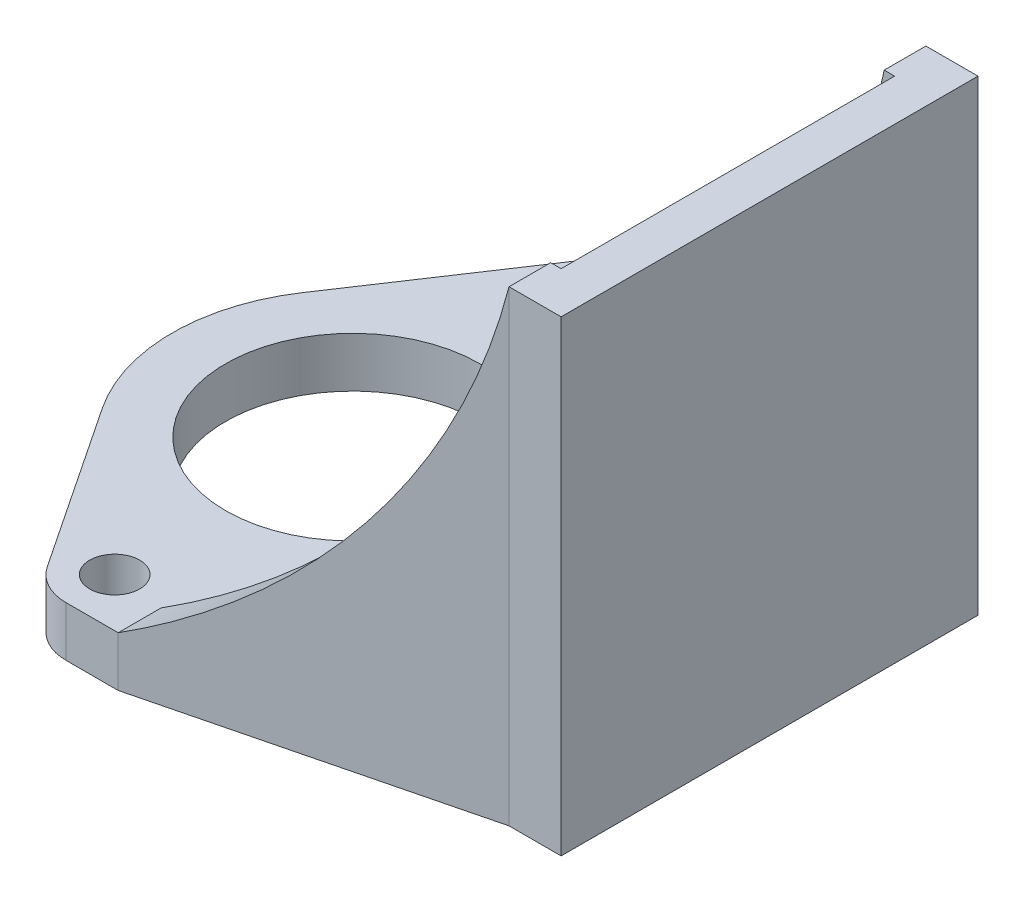
ISO-10303-21;
HEADER;
FILE_DESCRIPTION(('STEP AP214'),'2;1');
FILE_NAME('part.step','',(''),(''),'','','');
FILE_SCHEMA(('AUTOMOTIVE_DESIGN { 1 0 10303 214 1 1 1 1 }'));
ENDSEC;
DATA;
#1=APPLICATION_CONTEXT('core data for automotive mechanical design processes');
#2=APPLICATION_PROTOCOL_DEFINITION('international standard','automotive_design',2000,#1);
#3=PRODUCT_CONTEXT('',#1,'mechanical');
#4=PRODUCT('Part','Part','',(#3));
#5=PRODUCT_RELATED_PRODUCT_CATEGORY('part','',(#4));
#6=PRODUCT_DEFINITION_FORMATION('','',#4);
#7=PRODUCT_DEFINITION_CONTEXT('part definition',#1,'design');
#8=PRODUCT_DEFINITION('design','',#6,#7);
#9=PRODUCT_DEFINITION_SHAPE('','',#8);
#10=(LENGTH_UNIT() NAMED_UNIT(*) SI_UNIT(.MILLI.,.METRE.));
#11=(NAMED_UNIT(*) PLANE_ANGLE_UNIT() SI_UNIT($,.RADIAN.));
#12=(NAMED_UNIT(*) SI_UNIT($,.STERADIAN.) SOLID_ANGLE_UNIT());
#13=UNCERTAINTY_MEASURE_WITH_UNIT(LENGTH_MEASURE(1.E-05),#10,'distance_accuracy_value','');
#14=(GEOMETRIC_REPRESENTATION_CONTEXT(3) GLOBAL_UNCERTAINTY_ASSIGNED_CONTEXT((#13)) GLOBAL_UNIT_ASSIGNED_CONTEXT((#10,
#11,#12)) REPRESENTATION_CONTEXT('',''));
#15=CARTESIAN_POINT('',(0.,0.,0.));
#16=DIRECTION('',(0.,0.,1.));
#17=DIRECTION('',(1.,0.,0.));
#18=AXIS2_PLACEMENT_3D('',#15,#16,#17);
#19=CARTESIAN_POINT('',(0.,3.048,-14.5));
#20=DIRECTION('',(0.,1.,0.));
#21=DIRECTION('',(0.,0.,1.));
#22=AXIS2_PLACEMENT_3D('',#19,#20,#21);
#23=PLANE('',#22);
#24=CARTESIAN_POINT('',(0.,3.048,0.));
#25=DIRECTION('',(0.,1.,0.));
#26=DIRECTION('',(0.,0.,1.));
#27=AXIS2_PLACEMENT_3D('',#24,#25,#26);
#28=CIRCLE('',#27,7.75);
#29=CARTESIAN_POINT('',(0.,3.048,7.75));
#30=VERTEX_POINT('',#29);
#31=EDGE_CURVE('E367',#30,#30,#28,.T.);
#32=ORIENTED_EDGE('',*,*,#31,.F.);
#33=EDGE_LOOP('',(#32));
#34=FACE_BOUND('',#33,.T.);
#35=DIRECTION('',(0.970142500145332,0.,0.242535625036333));
#36=VECTOR('',#35,1.);
#37=CARTESIAN_POINT('',(21.9123117109311,3.048,-10.16));
#38=LINE('',#37,#36);
#39=CARTESIAN_POINT('',(3.175,3.048,-14.8443279277328));
#40=VERTEX_POINT('',#39);
#41=CARTESIAN_POINT('',(21.9123117109311,3.048,-10.16));
#42=VERTEX_POINT('',#41);
#43=EDGE_CURVE('E323',#40,#42,#38,.T.);
#44=ORIENTED_EDGE('',*,*,#43,.F.);
#45=DIRECTION('',(0.,0.,1.));
#46=VECTOR('',#45,1.);
#47=CARTESIAN_POINT('',(3.175,3.048,-17.4625));
#48=LINE('',#47,#46);
#49=CARTESIAN_POINT('',(3.175,3.048,-17.4625));
#50=VERTEX_POINT('',#49);
#51=EDGE_CURVE('E225',#50,#40,#48,.T.);
#52=ORIENTED_EDGE('',*,*,#51,.F.);
#53=DIRECTION('',(-1.,0.,0.));
#54=VECTOR('',#53,1.);
#55=CARTESIAN_POINT('',(0.,3.048,-17.4625));
#56=LINE('',#55,#54);
#57=CARTESIAN_POINT('',(0.,3.048,-17.4625));
#58=VERTEX_POINT('',#57);
#59=EDGE_CURVE('E238',#50,#58,#56,.T.);
#60=ORIENTED_EDGE('',*,*,#59,.T.);
#61=CARTESIAN_POINT('',(0.,3.048,-14.5));
#62=DIRECTION('',(0.,1.,0.));
#63=DIRECTION('',(0.,0.,1.));
#64=AXIS2_PLACEMENT_3D('',#61,#62,#63);
#65=CIRCLE('',#64,2.9625);
#66=CARTESIAN_POINT('',(-2.46571856279075,3.048,-16.1421443965465));
#67=VERTEX_POINT('',#66);
#68=EDGE_CURVE('E375',#58,#67,#65,.T.);
#69=ORIENTED_EDGE('',*,*,#68,.T.);
#70=DIRECTION('',(-0.554310344825823,0.,0.832310063389286));
#71=VECTOR('',#70,1.);
#72=CARTESIAN_POINT('',(-9.15541069726086,3.048,-6.09741379306988));
#73=LINE('',#72,#71);
#74=CARTESIAN_POINT('',(-9.15541069726087,3.048,-6.09741379306988));
#75=VERTEX_POINT('',#74);
#76=EDGE_CURVE('E379',#67,#75,#73,.T.);
#77=ORIENTED_EDGE('',*,*,#76,.T.);
#78=CARTESIAN_POINT('',(0.,3.048,0.));
#79=DIRECTION('',(0.,1.,0.));
#80=DIRECTION('',(0.,0.,1.));
#81=AXIS2_PLACEMENT_3D('',#78,#79,#80);
#82=CIRCLE('',#81,10.9999999999744);
#83=CARTESIAN_POINT('',(-9.15541069726087,3.048,6.09741379306988));
#84=VERTEX_POINT('',#83);
#85=EDGE_CURVE('E383',#75,#84,#82,.T.);
#86=ORIENTED_EDGE('',*,*,#85,.T.);
#87=DIRECTION('',(0.554310344825823,0.,0.832310063389286));
#88=VECTOR('',#87,1.);
#89=CARTESIAN_POINT('',(-2.46571856279076,3.048,16.1421443965465));
#90=LINE('',#89,#88);
#91=CARTESIAN_POINT('',(-2.46571856279076,3.048,16.1421443965465));
#92=VERTEX_POINT('',#91);
#93=EDGE_CURVE('E386',#84,#92,#90,.T.);
#94=ORIENTED_EDGE('',*,*,#93,.T.);
#95=CARTESIAN_POINT('',(0.,3.048,14.5));
#96=DIRECTION('',(0.,1.,0.));
#97=DIRECTION('',(0.,0.,1.));
#98=AXIS2_PLACEMENT_3D('',#95,#96,#97);
#99=CIRCLE('',#98,2.9625);
#100=CARTESIAN_POINT('',(0.,3.048,17.4625));
#101=VERTEX_POINT('',#100);
#102=EDGE_CURVE('E233',#92,#101,#99,.T.);
#103=ORIENTED_EDGE('',*,*,#102,.T.);
#104=DIRECTION('',(1.,0.,0.));
#105=VECTOR('',#104,1.);
#106=CARTESIAN_POINT('',(0.,3.048,17.4625));
#107=LINE('',#106,#105);
#108=CARTESIAN_POINT('',(3.175,3.048,17.4625));
#109=VERTEX_POINT('',#108);
#110=EDGE_CURVE('E229',#101,#109,#107,.T.);
#111=ORIENTED_EDGE('',*,*,#110,.T.);
#112=DIRECTION('',(0.,0.,1.));
#113=VECTOR('',#112,1.);
#114=CARTESIAN_POINT('',(3.175,3.048,17.4625));
#115=LINE('',#114,#113);
#116=CARTESIAN_POINT('',(3.175,3.048,14.8443279277328));
#117=VERTEX_POINT('',#116);
#118=EDGE_CURVE('E202',#117,#109,#115,.T.);
#119=ORIENTED_EDGE('',*,*,#118,.F.);
#120=DIRECTION('',(-0.970142500145332,0.,0.242535625036333));
#121=VECTOR('',#120,1.);
#122=CARTESIAN_POINT('',(3.175,3.048,14.8443279277328));
#123=LINE('',#122,#121);
#124=CARTESIAN_POINT('',(21.9123117109311,3.048,10.16));
#125=VERTEX_POINT('',#124);
#126=EDGE_CURVE('E212',#125,#117,#123,.T.);
#127=ORIENTED_EDGE('',*,*,#126,.F.);
#128=DIRECTION('',(-1.,0.,0.));
#129=VECTOR('',#128,1.);
#130=CARTESIAN_POINT('',(21.9123117109311,3.048,10.16));
#131=LINE('',#130,#129);
#132=CARTESIAN_POINT('',(22.86,3.048,10.16));
#133=VERTEX_POINT('',#132);
#134=EDGE_CURVE('E334',#133,#125,#131,.T.);
#135=ORIENTED_EDGE('',*,*,#134,.F.);
#136=DIRECTION('',(0.,0.,1.));
#137=VECTOR('',#136,1.);
#138=CARTESIAN_POINT('',(22.86,3.048,10.16));
#139=LINE('',#138,#137);
#140=CARTESIAN_POINT('',(22.86,3.048,-10.16));
#141=VERTEX_POINT('',#140);
#142=EDGE_CURVE('E331',#141,#133,#139,.T.);
#143=ORIENTED_EDGE('',*,*,#142,.F.);
#144=DIRECTION('',(1.,0.,0.));
#145=VECTOR('',#144,1.);
#146=CARTESIAN_POINT('',(22.86,3.048,-10.16));
#147=LINE('',#146,#145);
#148=EDGE_CURVE('E327',#42,#141,#147,.T.);
#149=ORIENTED_EDGE('',*,*,#148,.F.);
#150=EDGE_LOOP('',(#44,#52,#60,#69,#77,#86,#94,#103,#111,#119,#127,#135,#143,#149));
#151=FACE_BOUND('',#150,.T.);
#152=CARTESIAN_POINT('',(0.,3.048,-14.5));
#153=DIRECTION('',(0.,1.,0.));
#154=DIRECTION('',(0.,0.,1.));
#155=AXIS2_PLACEMENT_3D('',#152,#153,#154);
#156=CIRCLE('',#155,1.524);
#157=CARTESIAN_POINT('',(0.,3.048,-12.976));
#158=VERTEX_POINT('',#157);
#159=EDGE_CURVE('E359',#158,#158,#156,.T.);
#160=ORIENTED_EDGE('',*,*,#159,.F.);
#161=EDGE_LOOP('',(#160));
#162=FACE_BOUND('',#161,.T.);
#163=CARTESIAN_POINT('',(0.,3.048,14.5));
#164=DIRECTION('',(0.,1.,0.));
#165=DIRECTION('',(0.,0.,1.));
#166=AXIS2_PLACEMENT_3D('',#163,#164,#165);
#167=CIRCLE('',#166,1.524);
#168=CARTESIAN_POINT('',(0.,3.048,16.024));
#169=VERTEX_POINT('',#168);
#170=EDGE_CURVE('E351',#169,#169,#167,.T.);
#171=ORIENTED_EDGE('',*,*,#170,.F.);
#172=EDGE_LOOP('',(#171));
#173=FACE_BOUND('',#172,.T.);
#174=ADVANCED_FACE('F40',(#34,#151,#162,#173),#23,.T.);
#175=CARTESIAN_POINT('',(0.,0.,-14.5));
#176=DIRECTION('',(0.,1.,0.));
#177=DIRECTION('',(0.,0.,1.));
#178=AXIS2_PLACEMENT_3D('',#175,#176,#177);
#179=PLANE('',#178);
#180=CARTESIAN_POINT('',(0.,0.,-14.5));
#181=DIRECTION('',(0.,1.,0.));
#182=DIRECTION('',(0.,0.,1.));
#183=AXIS2_PLACEMENT_3D('',#180,#181,#182);
#184=CIRCLE('',#183,2.9625);
#185=CARTESIAN_POINT('',(0.,0.,-17.4625));
#186=VERTEX_POINT('',#185);
#187=CARTESIAN_POINT('',(-2.46571856279075,0.,-16.1421443965465));
#188=VERTEX_POINT('',#187);
#189=EDGE_CURVE('E371',#186,#188,#184,.T.);
#190=ORIENTED_EDGE('',*,*,#189,.F.);
#191=DIRECTION('',(-1.,0.,0.));
#192=VECTOR('',#191,1.);
#193=CARTESIAN_POINT('',(0.,0.,-17.4625));
#194=LINE('',#193,#192);
#195=CARTESIAN_POINT('',(3.175,0.,-17.4625));
#196=VERTEX_POINT('',#195);
#197=EDGE_CURVE('E380',#196,#186,#194,.T.);
#198=ORIENTED_EDGE('',*,*,#197,.F.);
#199=DIRECTION('',(-0.970142500145332,0.,-0.242535625036333));
#200=VECTOR('',#199,1.);
#201=CARTESIAN_POINT('',(22.225,0.,-12.7));
#202=LINE('',#201,#200);
#203=CARTESIAN_POINT('',(22.225,0.,-12.7));
#204=VERTEX_POINT('',#203);
#205=EDGE_CURVE('E418',#204,#196,#202,.T.);
#206=ORIENTED_EDGE('',*,*,#205,.F.);
#207=DIRECTION('',(-1.,0.,0.));
#208=VECTOR('',#207,1.);
#209=CARTESIAN_POINT('',(22.225,0.,-12.7));
#210=LINE('',#209,#208);
#211=CARTESIAN_POINT('',(25.4,0.,-12.7));
#212=VERTEX_POINT('',#211);
#213=EDGE_CURVE('E302',#212,#204,#210,.T.);
#214=ORIENTED_EDGE('',*,*,#213,.F.);
#215=DIRECTION('',(0.,0.,-1.));
#216=VECTOR('',#215,1.);
#217=CARTESIAN_POINT('',(25.4,0.,-12.7));
#218=LINE('',#217,#216);
#219=CARTESIAN_POINT('',(25.4,0.,12.7));
#220=VERTEX_POINT('',#219);
#221=EDGE_CURVE('E413',#220,#212,#218,.T.);
#222=ORIENTED_EDGE('',*,*,#221,.F.);
#223=DIRECTION('',(1.,0.,0.));
#224=VECTOR('',#223,1.);
#225=CARTESIAN_POINT('',(25.4,0.,12.7));
#226=LINE('',#225,#224);
#227=CARTESIAN_POINT('',(22.225,0.,12.7));
#228=VERTEX_POINT('',#227);
#229=EDGE_CURVE('E410',#228,#220,#226,.T.);
#230=ORIENTED_EDGE('',*,*,#229,.F.);
#231=DIRECTION('',(0.970142500145332,0.,-0.242535625036333));
#232=VECTOR('',#231,1.);
#233=CARTESIAN_POINT('',(3.175,0.,17.4625));
#234=LINE('',#233,#232);
#235=CARTESIAN_POINT('',(3.175,0.,17.4625));
#236=VERTEX_POINT('',#235);
#237=EDGE_CURVE('E407',#236,#228,#234,.T.);
#238=ORIENTED_EDGE('',*,*,#237,.F.);
#239=DIRECTION('',(1.,0.,0.));
#240=VECTOR('',#239,1.);
#241=CARTESIAN_POINT('',(0.,0.,17.4625));
#242=LINE('',#241,#240);
#243=CARTESIAN_POINT('',(0.,0.,17.4625));
#244=VERTEX_POINT('',#243);
#245=EDGE_CURVE('E242',#244,#236,#242,.T.);
#246=ORIENTED_EDGE('',*,*,#245,.F.);
#247=CARTESIAN_POINT('',(0.,0.,14.5));
#248=DIRECTION('',(0.,1.,0.));
#249=DIRECTION('',(0.,0.,1.));
#250=AXIS2_PLACEMENT_3D('',#247,#248,#249);
#251=CIRCLE('',#250,2.9625);
#252=CARTESIAN_POINT('',(-2.46571856279076,0.,16.1421443965465));
#253=VERTEX_POINT('',#252);
#254=EDGE_CURVE('E403',#253,#244,#251,.T.);
#255=ORIENTED_EDGE('',*,*,#254,.F.);
#256=DIRECTION('',(0.554310344825823,0.,0.832310063389286));
#257=VECTOR('',#256,1.);
#258=CARTESIAN_POINT('',(-2.46571856279076,0.,16.1421443965465));
#259=LINE('',#258,#257);
#260=CARTESIAN_POINT('',(-9.15541069726087,0.,6.09741379306988));
#261=VERTEX_POINT('',#260);
#262=EDGE_CURVE('E400',#261,#253,#259,.T.);
#263=ORIENTED_EDGE('',*,*,#262,.F.);
#264=CARTESIAN_POINT('',(0.,0.,0.));
#265=DIRECTION('',(0.,1.,0.));
#266=DIRECTION('',(0.,0.,1.));
#267=AXIS2_PLACEMENT_3D('',#264,#265,#266);
#268=CIRCLE('',#267,10.9999999999744);
#269=CARTESIAN_POINT('',(-9.15541069726087,0.,-6.09741379306988));
#270=VERTEX_POINT('',#269);
#271=EDGE_CURVE('E397',#270,#261,#268,.T.);
#272=ORIENTED_EDGE('',*,*,#271,.F.);
#273=DIRECTION('',(-0.554310344825823,0.,0.832310063389286));
#274=VECTOR('',#273,1.);
#275=CARTESIAN_POINT('',(-9.15541069726086,0.,-6.09741379306988));
#276=LINE('',#275,#274);
#277=EDGE_CURVE('E395',#188,#270,#276,.T.);
#278=ORIENTED_EDGE('',*,*,#277,.F.);
#279=EDGE_LOOP('',(#190,#198,#206,#214,#222,#230,#238,#246,#255,#263,#272,#278));
#280=FACE_BOUND('',#279,.T.);
#281=CARTESIAN_POINT('',(0.,0.,0.));
#282=DIRECTION('',(0.,1.,0.));
#283=DIRECTION('',(0.,0.,1.));
#284=AXIS2_PLACEMENT_3D('',#281,#282,#283);
#285=CIRCLE('',#284,7.75);
#286=CARTESIAN_POINT('',(0.,0.,7.75));
#287=VERTEX_POINT('',#286);
#288=EDGE_CURVE('E363',#287,#287,#285,.T.);
#289=ORIENTED_EDGE('',*,*,#288,.T.);
#290=EDGE_LOOP('',(#289));
#291=FACE_BOUND('',#290,.T.);
#292=CARTESIAN_POINT('',(0.,0.,-14.5));
#293=DIRECTION('',(0.,1.,0.));
#294=DIRECTION('',(0.,0.,1.));
#295=AXIS2_PLACEMENT_3D('',#292,#293,#294);
#296=CIRCLE('',#295,1.524);
#297=CARTESIAN_POINT('',(0.,0.,-12.976));
#298=VERTEX_POINT('',#297);
#299=EDGE_CURVE('E355',#298,#298,#296,.T.);
#300=ORIENTED_EDGE('',*,*,#299,.T.);
#301=EDGE_LOOP('',(#300));
#302=FACE_BOUND('',#301,.T.);
#303=CARTESIAN_POINT('',(0.,0.,14.5));
#304=DIRECTION('',(0.,1.,0.));
#305=DIRECTION('',(0.,0.,1.));
#306=AXIS2_PLACEMENT_3D('',#303,#304,#305);
#307=CIRCLE('',#306,1.524);
#308=CARTESIAN_POINT('',(0.,0.,16.024));
#309=VERTEX_POINT('',#308);
#310=EDGE_CURVE('E350',#309,#309,#307,.T.);
#311=ORIENTED_EDGE('',*,*,#310,.T.);
#312=EDGE_LOOP('',(#311));
#313=FACE_BOUND('',#312,.T.);
#314=ADVANCED_FACE('F438',(#280,#291,#302,#313),#179,.F.);
#315=CARTESIAN_POINT('',(0.,3.048,-14.5));
#316=DIRECTION('',(0.,-1.,0.));
#317=DIRECTION('',(0.,0.,-1.));
#318=AXIS2_PLACEMENT_3D('',#315,#316,#317);
#319=CYLINDRICAL_SURFACE('',#318,2.9625);
#320=ORIENTED_EDGE('',*,*,#189,.T.);
#321=DIRECTION('',(0.,-1.,0.));
#322=VECTOR('',#321,1.);
#323=CARTESIAN_POINT('',(-2.46571856279075,3.048,-16.1421443965465));
#324=LINE('',#323,#322);
#325=EDGE_CURVE('E266',#67,#188,#324,.T.);
#326=ORIENTED_EDGE('',*,*,#325,.F.);
#327=ORIENTED_EDGE('',*,*,#68,.F.);
#328=DIRECTION('',(0.,-1.,0.));
#329=VECTOR('',#328,1.);
#330=CARTESIAN_POINT('',(0.,3.048,-17.4625));
#331=LINE('',#330,#329);
#332=EDGE_CURVE('E393',#58,#186,#331,.T.);
#333=ORIENTED_EDGE('',*,*,#332,.T.);
#334=EDGE_LOOP('',(#320,#326,#327,#333));
#335=FACE_BOUND('',#334,.T.);
#336=ADVANCED_FACE('F42',(#335),#319,.T.);
#337=CARTESIAN_POINT('',(-9.15541069726086,3.048,-6.09741379306988));
#338=DIRECTION('',(0.832310063389286,0.,0.554310344825823));
#339=DIRECTION('',(0.554310344825823,0.,-0.832310063389286));
#340=AXIS2_PLACEMENT_3D('',#337,#338,#339);
#341=PLANE('',#340);
#342=ORIENTED_EDGE('',*,*,#277,.T.);
#343=DIRECTION('',(0.,-1.,0.));
#344=VECTOR('',#343,1.);
#345=CARTESIAN_POINT('',(-9.15541069726087,3.048,-6.09741379306988));
#346=LINE('',#345,#344);
#347=EDGE_CURVE('E263',#75,#270,#346,.T.);
#348=ORIENTED_EDGE('',*,*,#347,.F.);
#349=ORIENTED_EDGE('',*,*,#76,.F.);
#350=ORIENTED_EDGE('',*,*,#325,.T.);
#351=EDGE_LOOP('',(#342,#348,#349,#350));
#352=FACE_BOUND('',#351,.T.);
#353=ADVANCED_FACE('F665',(#352),#341,.F.);
#354=CARTESIAN_POINT('',(0.,3.048,0.));
#355=DIRECTION('',(0.,-1.,0.));
#356=DIRECTION('',(0.,0.,-1.));
#357=AXIS2_PLACEMENT_3D('',#354,#355,#356);
#358=CYLINDRICAL_SURFACE('',#357,10.9999999999744);
#359=ORIENTED_EDGE('',*,*,#271,.T.);
#360=DIRECTION('',(0.,-1.,0.));
#361=VECTOR('',#360,1.);
#362=CARTESIAN_POINT('',(-9.15541069726087,3.048,6.09741379306988));
#363=LINE('',#362,#361);
#364=EDGE_CURVE('E259',#84,#261,#363,.T.);
#365=ORIENTED_EDGE('',*,*,#364,.F.);
#366=ORIENTED_EDGE('',*,*,#85,.F.);
#367=ORIENTED_EDGE('',*,*,#347,.T.);
#368=EDGE_LOOP('',(#359,#365,#366,#367));
#369=FACE_BOUND('',#368,.T.);
#370=ADVANCED_FACE('F656',(#369),#358,.T.);
#371=CARTESIAN_POINT('',(-2.46571856279076,3.048,16.1421443965465));
#372=DIRECTION('',(0.832310063389286,0.,-0.554310344825823));
#373=DIRECTION('',(-0.554310344825823,0.,-0.832310063389286));
#374=AXIS2_PLACEMENT_3D('',#371,#372,#373);
#375=PLANE('',#374);
#376=ORIENTED_EDGE('',*,*,#262,.T.);
#377=DIRECTION('',(0.,-1.,0.));
#378=VECTOR('',#377,1.);
#379=CARTESIAN_POINT('',(-2.46571856279076,3.048,16.1421443965465));
#380=LINE('',#379,#378);
#381=EDGE_CURVE('E249',#92,#253,#380,.T.);
#382=ORIENTED_EDGE('',*,*,#381,.F.);
#383=ORIENTED_EDGE('',*,*,#93,.F.);
#384=ORIENTED_EDGE('',*,*,#364,.T.);
#385=EDGE_LOOP('',(#376,#382,#383,#384));
#386=FACE_BOUND('',#385,.T.);
#387=ADVANCED_FACE('F646',(#386),#375,.F.);
#388=CARTESIAN_POINT('',(0.,3.048,14.5));
#389=DIRECTION('',(0.,-1.,0.));
#390=DIRECTION('',(0.,0.,-1.));
#391=AXIS2_PLACEMENT_3D('',#388,#389,#390);
#392=CYLINDRICAL_SURFACE('',#391,2.9625);
#393=ORIENTED_EDGE('',*,*,#254,.T.);
#394=DIRECTION('',(0.,-1.,0.));
#395=VECTOR('',#394,1.);
#396=CARTESIAN_POINT('',(0.,3.048,17.4625));
#397=LINE('',#396,#395);
#398=EDGE_CURVE('E244',#101,#244,#397,.T.);
#399=ORIENTED_EDGE('',*,*,#398,.F.);
#400=ORIENTED_EDGE('',*,*,#102,.F.);
#401=ORIENTED_EDGE('',*,*,#381,.T.);
#402=EDGE_LOOP('',(#393,#399,#400,#401));
#403=FACE_BOUND('',#402,.T.);
#404=ADVANCED_FACE('F597',(#403),#392,.T.);
#405=CARTESIAN_POINT('',(0.,3.048,17.4625));
#406=DIRECTION('',(0.,0.,-1.));
#407=DIRECTION('',(-1.,0.,0.));
#408=AXIS2_PLACEMENT_3D('',#405,#406,#407);
#409=PLANE('',#408);
#410=ORIENTED_EDGE('',*,*,#245,.T.);
#411=DIRECTION('',(0.,-1.,0.));
#412=VECTOR('',#411,1.);
#413=CARTESIAN_POINT('',(3.175,3.048,17.4625));
#414=LINE('',#413,#412);
#415=EDGE_CURVE('E219',#109,#236,#414,.T.);
#416=ORIENTED_EDGE('',*,*,#415,.F.);
#417=ORIENTED_EDGE('',*,*,#110,.F.);
#418=ORIENTED_EDGE('',*,*,#398,.T.);
#419=EDGE_LOOP('',(#410,#416,#417,#418));
#420=FACE_BOUND('',#419,.T.);
#421=ADVANCED_FACE('F240',(#420),#409,.F.);
#422=CARTESIAN_POINT('',(3.175,3.048,17.4625));
#423=DIRECTION('',(-0.242535625036333,0.,-0.970142500145332));
#424=DIRECTION('',(-0.970142500145332,0.,0.242535625036333));
#425=AXIS2_PLACEMENT_3D('',#422,#423,#424);
#426=PLANE('',#425);
#427=DIRECTION('',(0.,-1.,0.));
#428=VECTOR('',#427,1.);
#429=CARTESIAN_POINT('',(22.225,3.048,12.7));
#430=LINE('',#429,#428);
#431=CARTESIAN_POINT('',(22.225,28.448,12.7));
#432=VERTEX_POINT('',#431);
#433=EDGE_CURVE('E222',#432,#228,#430,.T.);
#434=ORIENTED_EDGE('',*,*,#433,.F.);
#435=CARTESIAN_POINT('',(-15.0081287711747,36.529096578381,22.0082821927937));
#436=DIRECTION('',(-0.242535625036333,0.,-0.970142500145332));
#437=DIRECTION('',(0.970142500145332,0.,-0.242535625036333));
#438=AXIS2_PLACEMENT_3D('',#435,#436,#437);
#439=ELLIPSE('',#438,39.2725810840082,38.1);
#440=EDGE_CURVE('E205',#432,#109,#439,.T.);
#441=ORIENTED_EDGE('',*,*,#440,.T.);
#442=ORIENTED_EDGE('',*,*,#415,.T.);
#443=ORIENTED_EDGE('',*,*,#237,.T.);
#444=EDGE_LOOP('',(#434,#441,#442,#443));
#445=FACE_BOUND('',#444,.T.);
#446=ADVANCED_FACE('F217',(#445),#426,.F.);
#447=CARTESIAN_POINT('',(25.4,3.048,12.7));
#448=DIRECTION('',(0.,0.,-1.));
#449=DIRECTION('',(-1.,0.,0.));
#450=AXIS2_PLACEMENT_3D('',#447,#448,#449);
#451=PLANE('',#450);
#452=ORIENTED_EDGE('',*,*,#229,.T.);
#453=DIRECTION('',(0.,-1.,0.));
#454=VECTOR('',#453,1.);
#455=CARTESIAN_POINT('',(25.4,3.048,12.7));
#456=LINE('',#455,#454);
#457=CARTESIAN_POINT('',(25.4,28.448,12.7));
#458=VERTEX_POINT('',#457);
#459=EDGE_CURVE('E252',#458,#220,#456,.T.);
#460=ORIENTED_EDGE('',*,*,#459,.F.);
#461=DIRECTION('',(1.,0.,0.));
#462=VECTOR('',#461,1.);
#463=CARTESIAN_POINT('',(22.225,28.448,12.7));
#464=LINE('',#463,#462);
#465=EDGE_CURVE('E317',#432,#458,#464,.T.);
#466=ORIENTED_EDGE('',*,*,#465,.F.);
#467=ORIENTED_EDGE('',*,*,#433,.T.);
#468=EDGE_LOOP('',(#452,#460,#466,#467));
#469=FACE_BOUND('',#468,.T.);
#470=ADVANCED_FACE('F464',(#469),#451,.F.);
#471=CARTESIAN_POINT('',(25.4,3.048,-12.7));
#472=DIRECTION('',(-1.,0.,0.));
#473=DIRECTION('',(0.,0.,1.));
#474=AXIS2_PLACEMENT_3D('',#471,#472,#473);
#475=PLANE('',#474);
#476=ORIENTED_EDGE('',*,*,#221,.T.);
#477=DIRECTION('',(0.,-1.,0.));
#478=VECTOR('',#477,1.);
#479=CARTESIAN_POINT('',(25.4,3.048,-12.7));
#480=LINE('',#479,#478);
#481=CARTESIAN_POINT('',(25.4,28.448,-12.7));
#482=VERTEX_POINT('',#481);
#483=EDGE_CURVE('E304',#482,#212,#480,.T.);
#484=ORIENTED_EDGE('',*,*,#483,.F.);
#485=DIRECTION('',(0.,0.,-1.));
#486=VECTOR('',#485,1.);
#487=CARTESIAN_POINT('',(25.4,28.448,12.7));
#488=LINE('',#487,#486);
#489=EDGE_CURVE('E310',#458,#482,#488,.T.);
#490=ORIENTED_EDGE('',*,*,#489,.F.);
#491=ORIENTED_EDGE('',*,*,#459,.T.);
#492=EDGE_LOOP('',(#476,#484,#490,#491));
#493=FACE_BOUND('',#492,.T.);
#494=ADVANCED_FACE('F433',(#493),#475,.F.);
#495=CARTESIAN_POINT('',(22.225,3.048,-12.7));
#496=DIRECTION('',(0.,0.,1.));
#497=DIRECTION('',(1.,0.,0.));
#498=AXIS2_PLACEMENT_3D('',#495,#496,#497);
#499=PLANE('',#498);
#500=ORIENTED_EDGE('',*,*,#213,.T.);
#501=DIRECTION('',(0.,-1.,0.));
#502=VECTOR('',#501,1.);
#503=CARTESIAN_POINT('',(22.225,3.048,-12.7));
#504=LINE('',#503,#502);
#505=CARTESIAN_POINT('',(22.225,28.448,-12.7));
#506=VERTEX_POINT('',#505);
#507=EDGE_CURVE('E288',#506,#204,#504,.T.);
#508=ORIENTED_EDGE('',*,*,#507,.F.);
#509=DIRECTION('',(-1.,0.,0.));
#510=VECTOR('',#509,1.);
#511=CARTESIAN_POINT('',(25.4,28.448,-12.7));
#512=LINE('',#511,#510);
#513=EDGE_CURVE('E300',#482,#506,#512,.T.);
#514=ORIENTED_EDGE('',*,*,#513,.F.);
#515=ORIENTED_EDGE('',*,*,#483,.T.);
#516=EDGE_LOOP('',(#500,#508,#514,#515));
#517=FACE_BOUND('',#516,.T.);
#518=ADVANCED_FACE('F298',(#517),#499,.F.);
#519=CARTESIAN_POINT('',(22.225,3.048,-12.7));
#520=DIRECTION('',(-0.242535625036333,0.,0.970142500145332));
#521=DIRECTION('',(0.970142500145332,0.,0.242535625036333));
#522=AXIS2_PLACEMENT_3D('',#519,#520,#521);
#523=PLANE('',#522);
#524=DIRECTION('',(0.,-1.,0.));
#525=VECTOR('',#524,1.);
#526=CARTESIAN_POINT('',(3.175,3.048,-17.4625));
#527=LINE('',#526,#525);
#528=EDGE_CURVE('E291',#50,#196,#527,.T.);
#529=ORIENTED_EDGE('',*,*,#528,.F.);
#530=CARTESIAN_POINT('',(-15.0081287711747,36.529096578381,-22.0082821927937));
#531=DIRECTION('',(-0.242535625036333,0.,0.970142500145332));
#532=DIRECTION('',(-0.970142500145332,0.,-0.242535625036333));
#533=AXIS2_PLACEMENT_3D('',#530,#531,#532);
#534=ELLIPSE('',#533,39.2725810840082,38.1);
#535=EDGE_CURVE('E226',#50,#506,#534,.T.);
#536=ORIENTED_EDGE('',*,*,#535,.T.);
#537=ORIENTED_EDGE('',*,*,#507,.T.);
#538=ORIENTED_EDGE('',*,*,#205,.T.);
#539=EDGE_LOOP('',(#529,#536,#537,#538));
#540=FACE_BOUND('',#539,.T.);
#541=ADVANCED_FACE('F287',(#540),#523,.F.);
#542=CARTESIAN_POINT('',(0.,3.048,-17.4625));
#543=DIRECTION('',(0.,0.,1.));
#544=DIRECTION('',(1.,0.,0.));
#545=AXIS2_PLACEMENT_3D('',#542,#543,#544);
#546=PLANE('',#545);
#547=ORIENTED_EDGE('',*,*,#197,.T.);
#548=ORIENTED_EDGE('',*,*,#332,.F.);
#549=ORIENTED_EDGE('',*,*,#59,.F.);
#550=ORIENTED_EDGE('',*,*,#528,.T.);
#551=EDGE_LOOP('',(#547,#548,#549,#550));
#552=FACE_BOUND('',#551,.T.);
#553=ADVANCED_FACE('F442',(#552),#546,.F.);
#554=CARTESIAN_POINT('',(0.,3.048,0.));
#555=DIRECTION('',(0.,-1.,0.));
#556=DIRECTION('',(0.,0.,-1.));
#557=AXIS2_PLACEMENT_3D('',#554,#555,#556);
#558=CYLINDRICAL_SURFACE('',#557,7.75);
#559=ORIENTED_EDGE('',*,*,#31,.T.);
#560=EDGE_LOOP('',(#559));
#561=FACE_BOUND('',#560,.T.);
#562=ORIENTED_EDGE('',*,*,#288,.F.);
#563=EDGE_LOOP('',(#562));
#564=FACE_BOUND('',#563,.T.);
#565=ADVANCED_FACE('F482',(#561,#564),#558,.F.);
#566=CARTESIAN_POINT('',(0.,3.048,-14.5));
#567=DIRECTION('',(0.,-1.,0.));
#568=DIRECTION('',(0.,0.,-1.));
#569=AXIS2_PLACEMENT_3D('',#566,#567,#568);
#570=CYLINDRICAL_SURFACE('',#569,1.524);
#571=ORIENTED_EDGE('',*,*,#159,.T.);
#572=EDGE_LOOP('',(#571));
#573=FACE_BOUND('',#572,.T.);
#574=ORIENTED_EDGE('',*,*,#299,.F.);
#575=EDGE_LOOP('',(#574));
#576=FACE_BOUND('',#575,.T.);
#577=ADVANCED_FACE('F510',(#573,#576),#570,.F.);
#578=CARTESIAN_POINT('',(0.,3.048,14.5));
#579=DIRECTION('',(0.,-1.,0.));
#580=DIRECTION('',(0.,0.,-1.));
#581=AXIS2_PLACEMENT_3D('',#578,#579,#580);
#582=CYLINDRICAL_SURFACE('',#581,1.524);
#583=ORIENTED_EDGE('',*,*,#170,.T.);
#584=EDGE_LOOP('',(#583));
#585=FACE_BOUND('',#584,.T.);
#586=ORIENTED_EDGE('',*,*,#310,.F.);
#587=EDGE_LOOP('',(#586));
#588=FACE_BOUND('',#587,.T.);
#589=ADVANCED_FACE('F516',(#585,#588),#582,.F.);
#590=CARTESIAN_POINT('',(21.9123117109311,28.448,-10.16));
#591=DIRECTION('',(0.242535625036333,0.,-0.970142500145332));
#592=DIRECTION('',(-0.970142500145332,0.,-0.242535625036333));
#593=AXIS2_PLACEMENT_3D('',#590,#591,#592);
#594=PLANE('',#593);
#595=DIRECTION('',(0.,-1.,0.));
#596=VECTOR('',#595,1.);
#597=CARTESIAN_POINT('',(21.9123117109311,28.448,-10.16));
#598=LINE('',#597,#596);
#599=CARTESIAN_POINT('',(21.9123117109311,27.1221271084998,-10.16));
#600=VERTEX_POINT('',#599);
#601=EDGE_CURVE('E347',#600,#42,#598,.T.);
#602=ORIENTED_EDGE('',*,*,#601,.F.);
#603=CARTESIAN_POINT('',(-15.0081287711747,36.529096578381,-19.3901101205265));
#604=DIRECTION('',(0.242535625036333,0.,-0.970142500145332));
#605=DIRECTION('',(-0.970142500145332,0.,-0.242535625036333));
#606=AXIS2_PLACEMENT_3D('',#603,#604,#605);
#607=ELLIPSE('',#606,39.2725810840082,38.1);
#608=EDGE_CURVE('E294',#600,#40,#607,.T.);
#609=ORIENTED_EDGE('',*,*,#608,.T.);
#610=ORIENTED_EDGE('',*,*,#43,.T.);
#611=EDGE_LOOP('',(#602,#609,#610));
#612=FACE_BOUND('',#611,.T.);
#613=ADVANCED_FACE('F449',(#612),#594,.F.);
#614=CARTESIAN_POINT('',(22.86,28.448,-10.16));
#615=DIRECTION('',(0.,0.,-1.));
#616=DIRECTION('',(-1.,0.,0.));
#617=AXIS2_PLACEMENT_3D('',#614,#615,#616);
#618=PLANE('',#617);
#619=DIRECTION('',(1.,0.,0.));
#620=VECTOR('',#619,1.);
#621=CARTESIAN_POINT('',(22.86,28.448,-10.16));
#622=LINE('',#621,#620);
#623=CARTESIAN_POINT('',(22.225,28.448,-10.16));
#624=VERTEX_POINT('',#623);
#625=CARTESIAN_POINT('',(22.86,28.448,-10.16));
#626=VERTEX_POINT('',#625);
#627=EDGE_CURVE('E211',#624,#626,#622,.T.);
#628=ORIENTED_EDGE('',*,*,#627,.F.);
#629=CARTESIAN_POINT('',(-15.0081287711747,36.529096578381,-10.16));
#630=DIRECTION('',(0.,0.,-1.));
#631=DIRECTION('',(-1.,0.,0.));
#632=AXIS2_PLACEMENT_3D('',#629,#630,#631);
#633=CIRCLE('',#632,38.1);
#634=EDGE_CURVE('E59',#624,#600,#633,.T.);
#635=ORIENTED_EDGE('',*,*,#634,.T.);
#636=ORIENTED_EDGE('',*,*,#601,.T.);
#637=ORIENTED_EDGE('',*,*,#148,.T.);
#638=DIRECTION('',(0.,-1.,0.));
#639=VECTOR('',#638,1.);
#640=CARTESIAN_POINT('',(22.86,28.448,-10.16));
#641=LINE('',#640,#639);
#642=EDGE_CURVE('E343',#626,#141,#641,.T.);
#643=ORIENTED_EDGE('',*,*,#642,.F.);
#644=EDGE_LOOP('',(#628,#635,#636,#637,#643));
#645=FACE_BOUND('',#644,.T.);
#646=ADVANCED_FACE('F529',(#645),#618,.F.);
#647=CARTESIAN_POINT('',(22.86,28.448,10.16));
#648=DIRECTION('',(1.,0.,0.));
#649=DIRECTION('',(0.,0.,-1.));
#650=AXIS2_PLACEMENT_3D('',#647,#648,#649);
#651=PLANE('',#650);
#652=ORIENTED_EDGE('',*,*,#142,.T.);
#653=DIRECTION('',(0.,-1.,0.));
#654=VECTOR('',#653,1.);
#655=CARTESIAN_POINT('',(22.86,28.448,10.16));
#656=LINE('',#655,#654);
#657=CARTESIAN_POINT('',(22.86,28.448,10.16));
#658=VERTEX_POINT('',#657);
#659=EDGE_CURVE('E314',#658,#133,#656,.T.);
#660=ORIENTED_EDGE('',*,*,#659,.F.);
#661=DIRECTION('',(0.,0.,1.));
#662=VECTOR('',#661,1.);
#663=CARTESIAN_POINT('',(22.86,28.448,10.16));
#664=LINE('',#663,#662);
#665=EDGE_CURVE('E457',#626,#658,#664,.T.);
#666=ORIENTED_EDGE('',*,*,#665,.F.);
#667=ORIENTED_EDGE('',*,*,#642,.T.);
#668=EDGE_LOOP('',(#652,#660,#666,#667));
#669=FACE_BOUND('',#668,.T.);
#670=ADVANCED_FACE('F535',(#669),#651,.F.);
#671=CARTESIAN_POINT('',(21.9123117109311,28.448,10.16));
#672=DIRECTION('',(0.,0.,1.));
#673=DIRECTION('',(1.,0.,0.));
#674=AXIS2_PLACEMENT_3D('',#671,#672,#673);
#675=PLANE('',#674);
#676=DIRECTION('',(0.,-1.,0.));
#677=VECTOR('',#676,1.);
#678=CARTESIAN_POINT('',(21.9123117109311,28.448,10.16));
#679=LINE('',#678,#677);
#680=CARTESIAN_POINT('',(21.9123117109311,27.1221271084998,10.16));
#681=VERTEX_POINT('',#680);
#682=EDGE_CURVE('E70',#681,#125,#679,.T.);
#683=ORIENTED_EDGE('',*,*,#682,.F.);
#684=CARTESIAN_POINT('',(-15.0081287711747,36.529096578381,10.16));
#685=DIRECTION('',(0.,0.,1.));
#686=DIRECTION('',(1.,0.,0.));
#687=AXIS2_PLACEMENT_3D('',#684,#685,#686);
#688=CIRCLE('',#687,38.1);
#689=CARTESIAN_POINT('',(22.225,28.448,10.16));
#690=VERTEX_POINT('',#689);
#691=EDGE_CURVE('E452',#681,#690,#688,.T.);
#692=ORIENTED_EDGE('',*,*,#691,.T.);
#693=DIRECTION('',(-1.,0.,0.));
#694=VECTOR('',#693,1.);
#695=CARTESIAN_POINT('',(21.9123117109311,28.448,10.16));
#696=LINE('',#695,#694);
#697=EDGE_CURVE('E460',#658,#690,#696,.T.);
#698=ORIENTED_EDGE('',*,*,#697,.F.);
#699=ORIENTED_EDGE('',*,*,#659,.T.);
#700=ORIENTED_EDGE('',*,*,#134,.T.);
#701=EDGE_LOOP('',(#683,#692,#698,#699,#700));
#702=FACE_BOUND('',#701,.T.);
#703=ADVANCED_FACE('F544',(#702),#675,.F.);
#704=CARTESIAN_POINT('',(3.175,28.448,14.8443279277328));
#705=DIRECTION('',(0.242535625036333,0.,0.970142500145332));
#706=DIRECTION('',(0.970142500145332,0.,-0.242535625036333));
#707=AXIS2_PLACEMENT_3D('',#704,#705,#706);
#708=PLANE('',#707);
#709=ORIENTED_EDGE('',*,*,#126,.T.);
#710=CARTESIAN_POINT('',(-15.0081287711747,36.529096578381,19.3901101205265));
#711=DIRECTION('',(0.242535625036333,0.,0.970142500145332));
#712=DIRECTION('',(0.970142500145332,0.,-0.242535625036333));
#713=AXIS2_PLACEMENT_3D('',#710,#711,#712);
#714=ELLIPSE('',#713,39.2725810840082,38.1);
#715=EDGE_CURVE('E207',#117,#681,#714,.T.);
#716=ORIENTED_EDGE('',*,*,#715,.T.);
#717=ORIENTED_EDGE('',*,*,#682,.T.);
#718=EDGE_LOOP('',(#709,#716,#717));
#719=FACE_BOUND('',#718,.T.);
#720=ADVANCED_FACE('F551',(#719),#708,.F.);
#721=CARTESIAN_POINT('',(0.,28.448,0.));
#722=DIRECTION('',(0.,1.,0.));
#723=DIRECTION('',(0.,0.,1.));
#724=AXIS2_PLACEMENT_3D('',#721,#722,#723);
#725=PLANE('',#724);
#726=DIRECTION('',(0.,0.,-1.));
#727=VECTOR('',#726,1.);
#728=CARTESIAN_POINT('',(22.225,28.448,17.4625));
#729=LINE('',#728,#727);
#730=EDGE_CURVE('E11',#432,#690,#729,.T.);
#731=ORIENTED_EDGE('',*,*,#730,.F.);
#732=ORIENTED_EDGE('',*,*,#465,.T.);
#733=ORIENTED_EDGE('',*,*,#489,.T.);
#734=ORIENTED_EDGE('',*,*,#513,.T.);
#735=EDGE_CURVE('E44',#624,#506,#729,.T.);
#736=ORIENTED_EDGE('',*,*,#735,.F.);
#737=ORIENTED_EDGE('',*,*,#627,.T.);
#738=ORIENTED_EDGE('',*,*,#665,.T.);
#739=ORIENTED_EDGE('',*,*,#697,.T.);
#740=EDGE_LOOP('',(#731,#732,#733,#734,#736,#737,#738,#739));
#741=FACE_BOUND('',#740,.T.);
#742=ADVANCED_FACE('F307',(#741),#725,.T.);
#743=CARTESIAN_POINT('',(-15.0081287711747,36.529096578381,17.4625));
#744=DIRECTION('',(0.,0.,-1.));
#745=DIRECTION('',(-1.,0.,0.));
#746=AXIS2_PLACEMENT_3D('',#743,#744,#745);
#747=CYLINDRICAL_SURFACE('',#746,38.1);
#748=ORIENTED_EDGE('',*,*,#51,.T.);
#749=ORIENTED_EDGE('',*,*,#608,.F.);
#750=ORIENTED_EDGE('',*,*,#634,.F.);
#751=ORIENTED_EDGE('',*,*,#735,.T.);
#752=ORIENTED_EDGE('',*,*,#535,.F.);
#753=EDGE_LOOP('',(#748,#749,#750,#751,#752));
#754=FACE_BOUND('',#753,.T.);
#755=ADVANCED_FACE('F278',(#754),#747,.F.);
#756=ORIENTED_EDGE('',*,*,#730,.T.);
#757=ORIENTED_EDGE('',*,*,#691,.F.);
#758=ORIENTED_EDGE('',*,*,#715,.F.);
#759=ORIENTED_EDGE('',*,*,#118,.T.);
#760=ORIENTED_EDGE('',*,*,#440,.F.);
#761=EDGE_LOOP('',(#756,#757,#758,#759,#760));
#762=FACE_BOUND('',#761,.T.);
#763=ADVANCED_FACE('F204',(#762),#747,.F.);
#764=CLOSED_SHELL('',(#174,#314,#336,#353,#370,#387,#404,#421,#446,#470,#494,#518,#541,#553,
#565,#577,#589,#613,#646,#670,#703,#720,#742,#755,#763));
#765=MANIFOLD_SOLID_BREP('B2',#764);
#766=ADVANCED_BREP_SHAPE_REPRESENTATION('',(#18,#765),#14);
#767=SHAPE_DEFINITION_REPRESENTATION(#9,#766);
ENDSEC;
END-ISO-10303-21;
